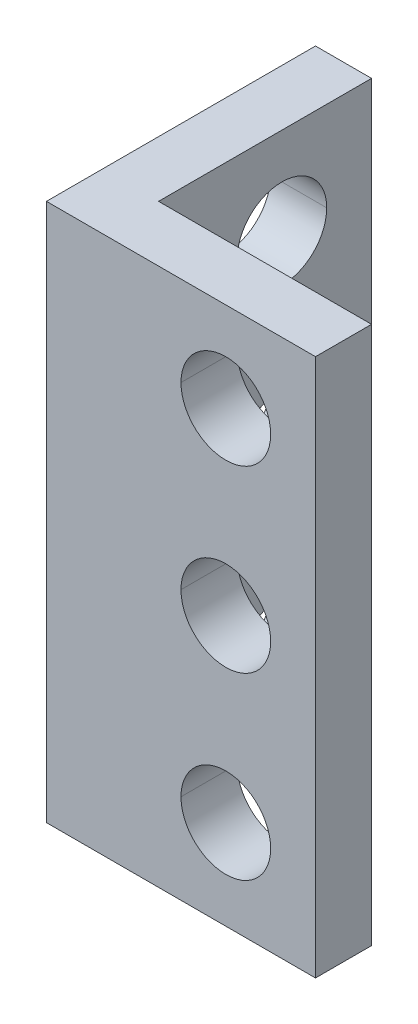
ISO-10303-21;
HEADER;
FILE_DESCRIPTION(('STEP AP214'),'2;1');
FILE_NAME('part.step','',(''),(''),'','','');
FILE_SCHEMA(('AUTOMOTIVE_DESIGN { 1 0 10303 214 1 1 1 1 }'));
ENDSEC;
DATA;
#1=APPLICATION_CONTEXT('core data for automotive mechanical design processes');
#2=APPLICATION_PROTOCOL_DEFINITION('international standard','automotive_design',2000,#1);
#3=PRODUCT_CONTEXT('',#1,'mechanical');
#4=PRODUCT('Part','Part','',(#3));
#5=PRODUCT_RELATED_PRODUCT_CATEGORY('part','',(#4));
#6=PRODUCT_DEFINITION_FORMATION('','',#4);
#7=PRODUCT_DEFINITION_CONTEXT('part definition',#1,'design');
#8=PRODUCT_DEFINITION('design','',#6,#7);
#9=PRODUCT_DEFINITION_SHAPE('','',#8);
#10=(LENGTH_UNIT() NAMED_UNIT(*) SI_UNIT(.MILLI.,.METRE.));
#11=(NAMED_UNIT(*) PLANE_ANGLE_UNIT() SI_UNIT($,.RADIAN.));
#12=(NAMED_UNIT(*) SI_UNIT($,.STERADIAN.) SOLID_ANGLE_UNIT());
#13=UNCERTAINTY_MEASURE_WITH_UNIT(LENGTH_MEASURE(1.E-05),#10,'distance_accuracy_value','');
#14=(GEOMETRIC_REPRESENTATION_CONTEXT(3) GLOBAL_UNCERTAINTY_ASSIGNED_CONTEXT((#13)) GLOBAL_UNIT_ASSIGNED_CONTEXT((#10,
#11,#12)) REPRESENTATION_CONTEXT('',''));
#15=CARTESIAN_POINT('',(0.,0.,0.));
#16=DIRECTION('',(0.,0.,1.));
#17=DIRECTION('',(1.,0.,0.));
#18=AXIS2_PLACEMENT_3D('',#15,#16,#17);
#19=CARTESIAN_POINT('',(12.,20.,-8.));
#20=DIRECTION('',(-1.,0.,0.));
#21=DIRECTION('',(0.,0.,1.));
#22=AXIS2_PLACEMENT_3D('',#19,#20,#21);
#23=CYLINDRICAL_SURFACE('',#22,2.);
#24=DIRECTION('',(-1.,0.,0.));
#25=VECTOR('',#24,1.);
#26=CARTESIAN_POINT('',(12.,20.,-10.));
#27=LINE('',#26,#25);
#28=CARTESIAN_POINT('',(2.5,20.,-10.));
#29=VERTEX_POINT('',#28);
#30=CARTESIAN_POINT('',(0.,20.,-10.));
#31=VERTEX_POINT('',#30);
#32=EDGE_CURVE('E275',#29,#31,#27,.T.);
#33=ORIENTED_EDGE('',*,*,#32,.F.);
#34=CARTESIAN_POINT('',(2.5,20.,-8.));
#35=DIRECTION('',(-1.,0.,0.));
#36=DIRECTION('',(0.,0.,1.));
#37=AXIS2_PLACEMENT_3D('',#34,#35,#36);
#38=CIRCLE('',#37,2.);
#39=CARTESIAN_POINT('',(2.5,20.,-6.));
#40=VERTEX_POINT('',#39);
#41=EDGE_CURVE('E302',#40,#29,#38,.T.);
#42=ORIENTED_EDGE('',*,*,#41,.F.);
#43=DIRECTION('',(-1.,0.,0.));
#44=VECTOR('',#43,1.);
#45=CARTESIAN_POINT('',(12.,20.,-6.));
#46=LINE('',#45,#44);
#47=CARTESIAN_POINT('',(0.,20.,-6.));
#48=VERTEX_POINT('',#47);
#49=EDGE_CURVE('E332',#40,#48,#46,.T.);
#50=ORIENTED_EDGE('',*,*,#49,.T.);
#51=CARTESIAN_POINT('',(0.,20.,-8.));
#52=DIRECTION('',(-1.,0.,0.));
#53=DIRECTION('',(0.,0.,1.));
#54=AXIS2_PLACEMENT_3D('',#51,#52,#53);
#55=CIRCLE('',#54,2.);
#56=EDGE_CURVE('E238',#48,#31,#55,.T.);
#57=ORIENTED_EDGE('',*,*,#56,.T.);
#58=EDGE_LOOP('',(#33,#42,#50,#57));
#59=FACE_BOUND('',#58,.T.);
#60=ADVANCED_FACE('F14',(#59),#23,.F.);
#61=CARTESIAN_POINT('',(12.,12.,-8.));
#62=DIRECTION('',(-1.,0.,0.));
#63=DIRECTION('',(0.,0.,1.));
#64=AXIS2_PLACEMENT_3D('',#61,#62,#63);
#65=CYLINDRICAL_SURFACE('',#64,2.);
#66=DIRECTION('',(-1.,0.,0.));
#67=VECTOR('',#66,1.);
#68=CARTESIAN_POINT('',(12.,12.,-10.));
#69=LINE('',#68,#67);
#70=CARTESIAN_POINT('',(2.5,12.,-10.));
#71=VERTEX_POINT('',#70);
#72=CARTESIAN_POINT('',(0.,12.,-10.));
#73=VERTEX_POINT('',#72);
#74=EDGE_CURVE('E284',#71,#73,#69,.T.);
#75=ORIENTED_EDGE('',*,*,#74,.F.);
#76=CARTESIAN_POINT('',(2.5,12.,-8.));
#77=DIRECTION('',(-1.,0.,0.));
#78=DIRECTION('',(0.,0.,1.));
#79=AXIS2_PLACEMENT_3D('',#76,#77,#78);
#80=CIRCLE('',#79,2.);
#81=CARTESIAN_POINT('',(2.5,12.,-6.));
#82=VERTEX_POINT('',#81);
#83=EDGE_CURVE('E271',#82,#71,#80,.T.);
#84=ORIENTED_EDGE('',*,*,#83,.F.);
#85=DIRECTION('',(-1.,0.,0.));
#86=VECTOR('',#85,1.);
#87=CARTESIAN_POINT('',(12.,12.,-6.));
#88=LINE('',#87,#86);
#89=CARTESIAN_POINT('',(0.,12.,-6.));
#90=VERTEX_POINT('',#89);
#91=EDGE_CURVE('E254',#82,#90,#88,.T.);
#92=ORIENTED_EDGE('',*,*,#91,.T.);
#93=CARTESIAN_POINT('',(0.,12.,-8.));
#94=DIRECTION('',(-1.,0.,0.));
#95=DIRECTION('',(0.,0.,1.));
#96=AXIS2_PLACEMENT_3D('',#93,#94,#95);
#97=CIRCLE('',#96,2.);
#98=EDGE_CURVE('E304',#90,#73,#97,.T.);
#99=ORIENTED_EDGE('',*,*,#98,.T.);
#100=EDGE_LOOP('',(#75,#84,#92,#99));
#101=FACE_BOUND('',#100,.T.);
#102=ADVANCED_FACE('F390',(#101),#65,.F.);
#103=CARTESIAN_POINT('',(8.,20.,-12.));
#104=DIRECTION('',(0.,0.,1.));
#105=DIRECTION('',(1.,0.,0.));
#106=AXIS2_PLACEMENT_3D('',#103,#104,#105);
#107=CYLINDRICAL_SURFACE('',#106,2.);
#108=DIRECTION('',(0.,0.,1.));
#109=VECTOR('',#108,1.);
#110=CARTESIAN_POINT('',(6.,20.,-12.));
#111=LINE('',#110,#109);
#112=CARTESIAN_POINT('',(6.,20.,-2.5));
#113=VERTEX_POINT('',#112);
#114=CARTESIAN_POINT('',(6.,20.,0.));
#115=VERTEX_POINT('',#114);
#116=EDGE_CURVE('E782',#113,#115,#111,.T.);
#117=ORIENTED_EDGE('',*,*,#116,.F.);
#118=CARTESIAN_POINT('',(8.,20.,-2.5));
#119=DIRECTION('',(0.,0.,1.));
#120=DIRECTION('',(-1.,0.,0.));
#121=AXIS2_PLACEMENT_3D('',#118,#119,#120);
#122=CIRCLE('',#121,2.);
#123=CARTESIAN_POINT('',(10.,20.,-2.50000000000004));
#124=VERTEX_POINT('',#123);
#125=EDGE_CURVE('E270',#124,#113,#122,.T.);
#126=ORIENTED_EDGE('',*,*,#125,.F.);
#127=DIRECTION('',(0.,0.,1.));
#128=VECTOR('',#127,1.);
#129=CARTESIAN_POINT('',(10.,20.,-12.));
#130=LINE('',#129,#128);
#131=CARTESIAN_POINT('',(10.,20.,0.));
#132=VERTEX_POINT('',#131);
#133=EDGE_CURVE('E285',#124,#132,#130,.T.);
#134=ORIENTED_EDGE('',*,*,#133,.T.);
#135=CARTESIAN_POINT('',(8.,20.,0.));
#136=DIRECTION('',(0.,0.,-1.));
#137=DIRECTION('',(-1.,0.,0.));
#138=AXIS2_PLACEMENT_3D('',#135,#136,#137);
#139=CIRCLE('',#138,2.);
#140=EDGE_CURVE('E325',#115,#132,#139,.T.);
#141=ORIENTED_EDGE('',*,*,#140,.F.);
#142=EDGE_LOOP('',(#117,#126,#134,#141));
#143=FACE_BOUND('',#142,.T.);
#144=ADVANCED_FACE('F395',(#143),#107,.F.);
#145=CARTESIAN_POINT('',(8.,12.,-12.));
#146=DIRECTION('',(0.,0.,1.));
#147=DIRECTION('',(1.,0.,0.));
#148=AXIS2_PLACEMENT_3D('',#145,#146,#147);
#149=CYLINDRICAL_SURFACE('',#148,2.);
#150=DIRECTION('',(0.,0.,1.));
#151=VECTOR('',#150,1.);
#152=CARTESIAN_POINT('',(6.,12.,-12.));
#153=LINE('',#152,#151);
#154=CARTESIAN_POINT('',(6.,12.,-2.5));
#155=VERTEX_POINT('',#154);
#156=CARTESIAN_POINT('',(6.,12.,0.));
#157=VERTEX_POINT('',#156);
#158=EDGE_CURVE('E242',#155,#157,#153,.T.);
#159=ORIENTED_EDGE('',*,*,#158,.F.);
#160=CARTESIAN_POINT('',(8.,12.,-2.5));
#161=DIRECTION('',(0.,0.,1.));
#162=DIRECTION('',(-1.,0.,0.));
#163=AXIS2_PLACEMENT_3D('',#160,#161,#162);
#164=CIRCLE('',#163,2.);
#165=CARTESIAN_POINT('',(10.,12.,-2.50000000000004));
#166=VERTEX_POINT('',#165);
#167=EDGE_CURVE('E216',#166,#155,#164,.T.);
#168=ORIENTED_EDGE('',*,*,#167,.F.);
#169=DIRECTION('',(0.,0.,1.));
#170=VECTOR('',#169,1.);
#171=CARTESIAN_POINT('',(10.,12.,-12.));
#172=LINE('',#171,#170);
#173=CARTESIAN_POINT('',(10.,12.,0.));
#174=VERTEX_POINT('',#173);
#175=EDGE_CURVE('E18',#166,#174,#172,.T.);
#176=ORIENTED_EDGE('',*,*,#175,.T.);
#177=CARTESIAN_POINT('',(8.,12.,0.));
#178=DIRECTION('',(0.,0.,-1.));
#179=DIRECTION('',(-1.,0.,0.));
#180=AXIS2_PLACEMENT_3D('',#177,#178,#179);
#181=CIRCLE('',#180,2.);
#182=EDGE_CURVE('E319',#157,#174,#181,.T.);
#183=ORIENTED_EDGE('',*,*,#182,.F.);
#184=EDGE_LOOP('',(#159,#168,#176,#183));
#185=FACE_BOUND('',#184,.T.);
#186=ADVANCED_FACE('F423',(#185),#149,.F.);
#187=CARTESIAN_POINT('',(0.,24.,0.));
#188=DIRECTION('',(0.,1.,0.));
#189=DIRECTION('',(1.,0.,0.));
#190=AXIS2_PLACEMENT_3D('',#187,#188,#189);
#191=PLANE('',#190);
#192=DIRECTION('',(1.,0.,0.));
#193=VECTOR('',#192,1.);
#194=CARTESIAN_POINT('',(0.,24.,-2.5));
#195=LINE('',#194,#193);
#196=CARTESIAN_POINT('',(2.5,24.,-2.5));
#197=VERTEX_POINT('',#196);
#198=CARTESIAN_POINT('',(12.,24.,-2.50000000000005));
#199=VERTEX_POINT('',#198);
#200=EDGE_CURVE('E202',#197,#199,#195,.T.);
#201=ORIENTED_EDGE('',*,*,#200,.F.);
#202=DIRECTION('',(0.,0.,-1.));
#203=VECTOR('',#202,1.);
#204=CARTESIAN_POINT('',(2.5,24.,0.));
#205=LINE('',#204,#203);
#206=CARTESIAN_POINT('',(2.5,24.,-12.));
#207=VERTEX_POINT('',#206);
#208=EDGE_CURVE('E274',#197,#207,#205,.T.);
#209=ORIENTED_EDGE('',*,*,#208,.T.);
#210=DIRECTION('',(1.,0.,0.));
#211=VECTOR('',#210,1.);
#212=CARTESIAN_POINT('',(0.,24.,-12.));
#213=LINE('',#212,#211);
#214=CARTESIAN_POINT('',(0.,24.,-12.));
#215=VERTEX_POINT('',#214);
#216=EDGE_CURVE('E234',#215,#207,#213,.T.);
#217=ORIENTED_EDGE('',*,*,#216,.F.);
#218=DIRECTION('',(0.,0.,-1.));
#219=VECTOR('',#218,1.);
#220=CARTESIAN_POINT('',(0.,24.,0.));
#221=LINE('',#220,#219);
#222=CARTESIAN_POINT('',(0.,24.,0.));
#223=VERTEX_POINT('',#222);
#224=EDGE_CURVE('E40',#223,#215,#221,.T.);
#225=ORIENTED_EDGE('',*,*,#224,.F.);
#226=DIRECTION('',(1.,0.,0.));
#227=VECTOR('',#226,1.);
#228=CARTESIAN_POINT('',(0.,24.,0.));
#229=LINE('',#228,#227);
#230=CARTESIAN_POINT('',(12.,24.,0.));
#231=VERTEX_POINT('',#230);
#232=EDGE_CURVE('E205',#223,#231,#229,.T.);
#233=ORIENTED_EDGE('',*,*,#232,.T.);
#234=DIRECTION('',(0.,0.,-1.));
#235=VECTOR('',#234,1.);
#236=CARTESIAN_POINT('',(12.,24.,0.));
#237=LINE('',#236,#235);
#238=EDGE_CURVE('E9',#231,#199,#237,.T.);
#239=ORIENTED_EDGE('',*,*,#238,.T.);
#240=EDGE_LOOP('',(#201,#209,#217,#225,#233,#239));
#241=FACE_BOUND('',#240,.T.);
#242=ADVANCED_FACE('F16',(#241),#191,.T.);
#243=CARTESIAN_POINT('',(8.,4.,-12.));
#244=DIRECTION('',(0.,0.,1.));
#245=DIRECTION('',(1.,0.,0.));
#246=AXIS2_PLACEMENT_3D('',#243,#244,#245);
#247=CYLINDRICAL_SURFACE('',#246,2.);
#248=DIRECTION('',(0.,0.,1.));
#249=VECTOR('',#248,1.);
#250=CARTESIAN_POINT('',(6.,4.,-12.));
#251=LINE('',#250,#249);
#252=CARTESIAN_POINT('',(6.,4.,-2.5));
#253=VERTEX_POINT('',#252);
#254=CARTESIAN_POINT('',(6.,4.,0.));
#255=VERTEX_POINT('',#254);
#256=EDGE_CURVE('E232',#253,#255,#251,.T.);
#257=ORIENTED_EDGE('',*,*,#256,.F.);
#258=CARTESIAN_POINT('',(8.,4.,-2.5));
#259=DIRECTION('',(0.,0.,1.));
#260=DIRECTION('',(-1.,0.,0.));
#261=AXIS2_PLACEMENT_3D('',#258,#259,#260);
#262=CIRCLE('',#261,2.);
#263=CARTESIAN_POINT('',(10.,4.,-2.50000000000004));
#264=VERTEX_POINT('',#263);
#265=EDGE_CURVE('E151',#264,#253,#262,.T.);
#266=ORIENTED_EDGE('',*,*,#265,.F.);
#267=DIRECTION('',(0.,0.,1.));
#268=VECTOR('',#267,1.);
#269=CARTESIAN_POINT('',(10.,4.,-12.));
#270=LINE('',#269,#268);
#271=CARTESIAN_POINT('',(10.,4.,0.));
#272=VERTEX_POINT('',#271);
#273=EDGE_CURVE('E264',#264,#272,#270,.T.);
#274=ORIENTED_EDGE('',*,*,#273,.T.);
#275=CARTESIAN_POINT('',(8.,4.,0.));
#276=DIRECTION('',(0.,0.,-1.));
#277=DIRECTION('',(-1.,0.,0.));
#278=AXIS2_PLACEMENT_3D('',#275,#276,#277);
#279=CIRCLE('',#278,2.);
#280=EDGE_CURVE('E805',#255,#272,#279,.T.);
#281=ORIENTED_EDGE('',*,*,#280,.F.);
#282=EDGE_LOOP('',(#257,#266,#274,#281));
#283=FACE_BOUND('',#282,.T.);
#284=ADVANCED_FACE('F491',(#283),#247,.F.);
#285=CARTESIAN_POINT('',(12.,4.,-8.));
#286=DIRECTION('',(-1.,0.,0.));
#287=DIRECTION('',(0.,0.,1.));
#288=AXIS2_PLACEMENT_3D('',#285,#286,#287);
#289=CYLINDRICAL_SURFACE('',#288,2.);
#290=DIRECTION('',(-1.,0.,0.));
#291=VECTOR('',#290,1.);
#292=CARTESIAN_POINT('',(12.,4.,-10.));
#293=LINE('',#292,#291);
#294=CARTESIAN_POINT('',(2.5,4.,-10.));
#295=VERTEX_POINT('',#294);
#296=CARTESIAN_POINT('',(0.,4.,-10.));
#297=VERTEX_POINT('',#296);
#298=EDGE_CURVE('E248',#295,#297,#293,.T.);
#299=ORIENTED_EDGE('',*,*,#298,.F.);
#300=CARTESIAN_POINT('',(2.5,4.,-8.));
#301=DIRECTION('',(-1.,0.,0.));
#302=DIRECTION('',(0.,0.,1.));
#303=AXIS2_PLACEMENT_3D('',#300,#301,#302);
#304=CIRCLE('',#303,2.);
#305=CARTESIAN_POINT('',(2.5,4.,-6.));
#306=VERTEX_POINT('',#305);
#307=EDGE_CURVE('E182',#306,#295,#304,.T.);
#308=ORIENTED_EDGE('',*,*,#307,.F.);
#309=DIRECTION('',(-1.,0.,0.));
#310=VECTOR('',#309,1.);
#311=CARTESIAN_POINT('',(12.,4.,-6.));
#312=LINE('',#311,#310);
#313=CARTESIAN_POINT('',(0.,4.,-6.));
#314=VERTEX_POINT('',#313);
#315=EDGE_CURVE('E778',#306,#314,#312,.T.);
#316=ORIENTED_EDGE('',*,*,#315,.T.);
#317=CARTESIAN_POINT('',(0.,4.,-8.));
#318=DIRECTION('',(-1.,0.,0.));
#319=DIRECTION('',(0.,0.,1.));
#320=AXIS2_PLACEMENT_3D('',#317,#318,#319);
#321=CIRCLE('',#320,2.);
#322=EDGE_CURVE('E175',#314,#297,#321,.T.);
#323=ORIENTED_EDGE('',*,*,#322,.T.);
#324=EDGE_LOOP('',(#299,#308,#316,#323));
#325=FACE_BOUND('',#324,.T.);
#326=ADVANCED_FACE('F381',(#325),#289,.F.);
#327=CARTESIAN_POINT('',(0.,0.,0.));
#328=DIRECTION('',(0.,1.,0.));
#329=DIRECTION('',(1.,0.,0.));
#330=AXIS2_PLACEMENT_3D('',#327,#328,#329);
#331=PLANE('',#330);
#332=DIRECTION('',(1.,0.,0.));
#333=VECTOR('',#332,1.);
#334=CARTESIAN_POINT('',(0.,0.,-2.5));
#335=LINE('',#334,#333);
#336=CARTESIAN_POINT('',(2.5,0.,-2.5));
#337=VERTEX_POINT('',#336);
#338=CARTESIAN_POINT('',(12.,0.,-2.50000000000005));
#339=VERTEX_POINT('',#338);
#340=EDGE_CURVE('E228',#337,#339,#335,.T.);
#341=ORIENTED_EDGE('',*,*,#340,.T.);
#342=DIRECTION('',(0.,0.,-1.));
#343=VECTOR('',#342,1.);
#344=CARTESIAN_POINT('',(12.,0.,0.));
#345=LINE('',#344,#343);
#346=CARTESIAN_POINT('',(12.,0.,0.));
#347=VERTEX_POINT('',#346);
#348=EDGE_CURVE('E25',#347,#339,#345,.T.);
#349=ORIENTED_EDGE('',*,*,#348,.F.);
#350=DIRECTION('',(1.,0.,0.));
#351=VECTOR('',#350,1.);
#352=CARTESIAN_POINT('',(0.,0.,0.));
#353=LINE('',#352,#351);
#354=CARTESIAN_POINT('',(0.,0.,0.));
#355=VERTEX_POINT('',#354);
#356=EDGE_CURVE('E265',#355,#347,#353,.T.);
#357=ORIENTED_EDGE('',*,*,#356,.F.);
#358=DIRECTION('',(0.,0.,-1.));
#359=VECTOR('',#358,1.);
#360=CARTESIAN_POINT('',(0.,0.,0.));
#361=LINE('',#360,#359);
#362=CARTESIAN_POINT('',(0.,0.,-12.));
#363=VERTEX_POINT('',#362);
#364=EDGE_CURVE('E236',#355,#363,#361,.T.);
#365=ORIENTED_EDGE('',*,*,#364,.T.);
#366=DIRECTION('',(1.,0.,0.));
#367=VECTOR('',#366,1.);
#368=CARTESIAN_POINT('',(0.,0.,-12.));
#369=LINE('',#368,#367);
#370=CARTESIAN_POINT('',(2.5,0.,-12.));
#371=VERTEX_POINT('',#370);
#372=EDGE_CURVE('E294',#363,#371,#369,.T.);
#373=ORIENTED_EDGE('',*,*,#372,.T.);
#374=DIRECTION('',(0.,0.,-1.));
#375=VECTOR('',#374,1.);
#376=CARTESIAN_POINT('',(2.5,0.,0.));
#377=LINE('',#376,#375);
#378=EDGE_CURVE('E321',#337,#371,#377,.T.);
#379=ORIENTED_EDGE('',*,*,#378,.F.);
#380=EDGE_LOOP('',(#341,#349,#357,#365,#373,#379));
#381=FACE_BOUND('',#380,.T.);
#382=ADVANCED_FACE('F376',(#381),#331,.F.);
#383=CARTESIAN_POINT('',(12.,8.,0.));
#384=DIRECTION('',(-1.,0.,0.));
#385=DIRECTION('',(0.,1.,0.));
#386=AXIS2_PLACEMENT_3D('',#383,#384,#385);
#387=PLANE('',#386);
#388=ORIENTED_EDGE('',*,*,#348,.T.);
#389=DIRECTION('',(0.,-1.,0.));
#390=VECTOR('',#389,1.);
#391=CARTESIAN_POINT('',(12.,8.,-2.50000000000005));
#392=LINE('',#391,#390);
#393=EDGE_CURVE('E210',#199,#339,#392,.T.);
#394=ORIENTED_EDGE('',*,*,#393,.F.);
#395=ORIENTED_EDGE('',*,*,#238,.F.);
#396=DIRECTION('',(0.,-1.,0.));
#397=VECTOR('',#396,1.);
#398=CARTESIAN_POINT('',(12.,8.,0.));
#399=LINE('',#398,#397);
#400=EDGE_CURVE('E269',#231,#347,#399,.T.);
#401=ORIENTED_EDGE('',*,*,#400,.T.);
#402=EDGE_LOOP('',(#388,#394,#395,#401));
#403=FACE_BOUND('',#402,.T.);
#404=ADVANCED_FACE('F211',(#403),#387,.F.);
#405=CARTESIAN_POINT('',(0.,8.,0.));
#406=DIRECTION('',(-1.,0.,0.));
#407=DIRECTION('',(0.,0.,1.));
#408=AXIS2_PLACEMENT_3D('',#405,#406,#407);
#409=PLANE('',#408);
#410=ORIENTED_EDGE('',*,*,#56,.F.);
#411=CARTESIAN_POINT('',(0.,20.,-8.));
#412=DIRECTION('',(-1.,0.,0.));
#413=DIRECTION('',(0.,0.,1.));
#414=AXIS2_PLACEMENT_3D('',#411,#412,#413);
#415=CIRCLE('',#414,2.);
#416=EDGE_CURVE('E279',#31,#48,#415,.T.);
#417=ORIENTED_EDGE('',*,*,#416,.F.);
#418=EDGE_LOOP('',(#410,#417));
#419=FACE_BOUND('',#418,.T.);
#420=ORIENTED_EDGE('',*,*,#322,.F.);
#421=CARTESIAN_POINT('',(0.,4.,-8.));
#422=DIRECTION('',(-1.,0.,0.));
#423=DIRECTION('',(0.,0.,1.));
#424=AXIS2_PLACEMENT_3D('',#421,#422,#423);
#425=CIRCLE('',#424,2.);
#426=EDGE_CURVE('E252',#297,#314,#425,.T.);
#427=ORIENTED_EDGE('',*,*,#426,.F.);
#428=EDGE_LOOP('',(#420,#427));
#429=FACE_BOUND('',#428,.T.);
#430=ORIENTED_EDGE('',*,*,#98,.F.);
#431=CARTESIAN_POINT('',(0.,12.,-8.));
#432=DIRECTION('',(-1.,0.,0.));
#433=DIRECTION('',(0.,0.,1.));
#434=AXIS2_PLACEMENT_3D('',#431,#432,#433);
#435=CIRCLE('',#434,2.);
#436=EDGE_CURVE('E259',#73,#90,#435,.T.);
#437=ORIENTED_EDGE('',*,*,#436,.F.);
#438=EDGE_LOOP('',(#430,#437));
#439=FACE_BOUND('',#438,.T.);
#440=ORIENTED_EDGE('',*,*,#364,.F.);
#441=DIRECTION('',(0.,-1.,0.));
#442=VECTOR('',#441,1.);
#443=CARTESIAN_POINT('',(0.,8.,0.));
#444=LINE('',#443,#442);
#445=EDGE_CURVE('E808',#223,#355,#444,.T.);
#446=ORIENTED_EDGE('',*,*,#445,.F.);
#447=ORIENTED_EDGE('',*,*,#224,.T.);
#448=DIRECTION('',(0.,-1.,0.));
#449=VECTOR('',#448,1.);
#450=CARTESIAN_POINT('',(0.,8.,-12.));
#451=LINE('',#450,#449);
#452=EDGE_CURVE('E237',#215,#363,#451,.T.);
#453=ORIENTED_EDGE('',*,*,#452,.T.);
#454=EDGE_LOOP('',(#440,#446,#447,#453));
#455=FACE_BOUND('',#454,.T.);
#456=ADVANCED_FACE('F459',(#419,#429,#439,#455),#409,.T.);
#457=CARTESIAN_POINT('',(0.,8.,-12.));
#458=DIRECTION('',(0.,0.,-1.));
#459=DIRECTION('',(0.,-1.,0.));
#460=AXIS2_PLACEMENT_3D('',#457,#458,#459);
#461=PLANE('',#460);
#462=ORIENTED_EDGE('',*,*,#372,.F.);
#463=ORIENTED_EDGE('',*,*,#452,.F.);
#464=ORIENTED_EDGE('',*,*,#216,.T.);
#465=DIRECTION('',(0.,-1.,0.));
#466=VECTOR('',#465,1.);
#467=CARTESIAN_POINT('',(2.5,8.,-12.));
#468=LINE('',#467,#466);
#469=EDGE_CURVE('E324',#207,#371,#468,.T.);
#470=ORIENTED_EDGE('',*,*,#469,.T.);
#471=EDGE_LOOP('',(#462,#463,#464,#470));
#472=FACE_BOUND('',#471,.T.);
#473=ADVANCED_FACE('F437',(#472),#461,.T.);
#474=CARTESIAN_POINT('',(2.5,8.,0.));
#475=DIRECTION('',(-1.,0.,0.));
#476=DIRECTION('',(0.,0.,1.));
#477=AXIS2_PLACEMENT_3D('',#474,#475,#476);
#478=PLANE('',#477);
#479=ORIENTED_EDGE('',*,*,#41,.T.);
#480=CARTESIAN_POINT('',(2.5,20.,-8.));
#481=DIRECTION('',(-1.,0.,0.));
#482=DIRECTION('',(0.,0.,1.));
#483=AXIS2_PLACEMENT_3D('',#480,#481,#482);
#484=CIRCLE('',#483,2.);
#485=EDGE_CURVE('E280',#29,#40,#484,.T.);
#486=ORIENTED_EDGE('',*,*,#485,.T.);
#487=EDGE_LOOP('',(#479,#486));
#488=FACE_BOUND('',#487,.T.);
#489=ORIENTED_EDGE('',*,*,#307,.T.);
#490=CARTESIAN_POINT('',(2.5,4.,-8.));
#491=DIRECTION('',(-1.,0.,0.));
#492=DIRECTION('',(0.,0.,1.));
#493=AXIS2_PLACEMENT_3D('',#490,#491,#492);
#494=CIRCLE('',#493,2.);
#495=EDGE_CURVE('E253',#295,#306,#494,.T.);
#496=ORIENTED_EDGE('',*,*,#495,.T.);
#497=EDGE_LOOP('',(#489,#496));
#498=FACE_BOUND('',#497,.T.);
#499=ORIENTED_EDGE('',*,*,#83,.T.);
#500=CARTESIAN_POINT('',(2.5,12.,-8.));
#501=DIRECTION('',(-1.,0.,0.));
#502=DIRECTION('',(0.,0.,1.));
#503=AXIS2_PLACEMENT_3D('',#500,#501,#502);
#504=CIRCLE('',#503,2.);
#505=EDGE_CURVE('E336',#71,#82,#504,.T.);
#506=ORIENTED_EDGE('',*,*,#505,.T.);
#507=EDGE_LOOP('',(#499,#506));
#508=FACE_BOUND('',#507,.T.);
#509=ORIENTED_EDGE('',*,*,#378,.T.);
#510=ORIENTED_EDGE('',*,*,#469,.F.);
#511=ORIENTED_EDGE('',*,*,#208,.F.);
#512=DIRECTION('',(0.,-1.,0.));
#513=VECTOR('',#512,1.);
#514=CARTESIAN_POINT('',(2.5,8.,-2.5));
#515=LINE('',#514,#513);
#516=EDGE_CURVE('E220',#197,#337,#515,.T.);
#517=ORIENTED_EDGE('',*,*,#516,.T.);
#518=EDGE_LOOP('',(#509,#510,#511,#517));
#519=FACE_BOUND('',#518,.T.);
#520=ADVANCED_FACE('F432',(#488,#498,#508,#519),#478,.F.);
#521=CARTESIAN_POINT('',(0.,8.,0.));
#522=DIRECTION('',(0.,0.,-1.));
#523=DIRECTION('',(-1.,0.,0.));
#524=AXIS2_PLACEMENT_3D('',#521,#522,#523);
#525=PLANE('',#524);
#526=CARTESIAN_POINT('',(8.,20.,0.));
#527=DIRECTION('',(0.,0.,-1.));
#528=DIRECTION('',(-1.,0.,0.));
#529=AXIS2_PLACEMENT_3D('',#526,#527,#528);
#530=CIRCLE('',#529,2.);
#531=EDGE_CURVE('E288',#132,#115,#530,.T.);
#532=ORIENTED_EDGE('',*,*,#531,.T.);
#533=ORIENTED_EDGE('',*,*,#140,.T.);
#534=EDGE_LOOP('',(#532,#533));
#535=FACE_BOUND('',#534,.T.);
#536=CARTESIAN_POINT('',(8.,12.,0.));
#537=DIRECTION('',(0.,0.,-1.));
#538=DIRECTION('',(-1.,0.,0.));
#539=AXIS2_PLACEMENT_3D('',#536,#537,#538);
#540=CIRCLE('',#539,2.);
#541=EDGE_CURVE('E246',#174,#157,#540,.T.);
#542=ORIENTED_EDGE('',*,*,#541,.T.);
#543=ORIENTED_EDGE('',*,*,#182,.T.);
#544=EDGE_LOOP('',(#542,#543));
#545=FACE_BOUND('',#544,.T.);
#546=CARTESIAN_POINT('',(8.,4.,0.));
#547=DIRECTION('',(0.,0.,-1.));
#548=DIRECTION('',(-1.,0.,0.));
#549=AXIS2_PLACEMENT_3D('',#546,#547,#548);
#550=CIRCLE('',#549,2.);
#551=EDGE_CURVE('E260',#272,#255,#550,.T.);
#552=ORIENTED_EDGE('',*,*,#551,.T.);
#553=ORIENTED_EDGE('',*,*,#280,.T.);
#554=EDGE_LOOP('',(#552,#553));
#555=FACE_BOUND('',#554,.T.);
#556=ORIENTED_EDGE('',*,*,#356,.T.);
#557=ORIENTED_EDGE('',*,*,#400,.F.);
#558=ORIENTED_EDGE('',*,*,#232,.F.);
#559=ORIENTED_EDGE('',*,*,#445,.T.);
#560=EDGE_LOOP('',(#556,#557,#558,#559));
#561=FACE_BOUND('',#560,.T.);
#562=ADVANCED_FACE('F410',(#535,#545,#555,#561),#525,.F.);
#563=CARTESIAN_POINT('',(0.,8.,-2.5));
#564=DIRECTION('',(0.,0.,-1.));
#565=DIRECTION('',(-1.,0.,0.));
#566=AXIS2_PLACEMENT_3D('',#563,#564,#565);
#567=PLANE('',#566);
#568=ORIENTED_EDGE('',*,*,#125,.T.);
#569=CARTESIAN_POINT('',(8.,20.,-2.5));
#570=DIRECTION('',(0.,0.,1.));
#571=DIRECTION('',(-1.,0.,0.));
#572=AXIS2_PLACEMENT_3D('',#569,#570,#571);
#573=CIRCLE('',#572,2.);
#574=EDGE_CURVE('E258',#113,#124,#573,.T.);
#575=ORIENTED_EDGE('',*,*,#574,.T.);
#576=EDGE_LOOP('',(#568,#575));
#577=FACE_BOUND('',#576,.T.);
#578=ORIENTED_EDGE('',*,*,#265,.T.);
#579=CARTESIAN_POINT('',(8.,4.,-2.5));
#580=DIRECTION('',(0.,0.,1.));
#581=DIRECTION('',(-1.,0.,0.));
#582=AXIS2_PLACEMENT_3D('',#579,#580,#581);
#583=CIRCLE('',#582,2.);
#584=EDGE_CURVE('E298',#253,#264,#583,.T.);
#585=ORIENTED_EDGE('',*,*,#584,.T.);
#586=EDGE_LOOP('',(#578,#585));
#587=FACE_BOUND('',#586,.T.);
#588=ORIENTED_EDGE('',*,*,#167,.T.);
#589=CARTESIAN_POINT('',(8.,12.,-2.5));
#590=DIRECTION('',(0.,0.,1.));
#591=DIRECTION('',(-1.,0.,0.));
#592=AXIS2_PLACEMENT_3D('',#589,#590,#591);
#593=CIRCLE('',#592,2.);
#594=EDGE_CURVE('E247',#155,#166,#593,.T.);
#595=ORIENTED_EDGE('',*,*,#594,.T.);
#596=EDGE_LOOP('',(#588,#595));
#597=FACE_BOUND('',#596,.T.);
#598=ORIENTED_EDGE('',*,*,#340,.F.);
#599=ORIENTED_EDGE('',*,*,#516,.F.);
#600=ORIENTED_EDGE('',*,*,#200,.T.);
#601=ORIENTED_EDGE('',*,*,#393,.T.);
#602=EDGE_LOOP('',(#598,#599,#600,#601));
#603=FACE_BOUND('',#602,.T.);
#604=ADVANCED_FACE('F218',(#577,#587,#597,#603),#567,.T.);
#605=CARTESIAN_POINT('',(12.,4.,-8.));
#606=DIRECTION('',(-1.,0.,0.));
#607=DIRECTION('',(0.,0.,1.));
#608=AXIS2_PLACEMENT_3D('',#605,#606,#607);
#609=CYLINDRICAL_SURFACE('',#608,2.);
#610=ORIENTED_EDGE('',*,*,#495,.F.);
#611=ORIENTED_EDGE('',*,*,#298,.T.);
#612=ORIENTED_EDGE('',*,*,#426,.T.);
#613=ORIENTED_EDGE('',*,*,#315,.F.);
#614=EDGE_LOOP('',(#610,#611,#612,#613));
#615=FACE_BOUND('',#614,.T.);
#616=ADVANCED_FACE('F409',(#615),#609,.F.);
#617=CARTESIAN_POINT('',(8.,4.,-12.));
#618=DIRECTION('',(0.,0.,1.));
#619=DIRECTION('',(1.,0.,0.));
#620=AXIS2_PLACEMENT_3D('',#617,#618,#619);
#621=CYLINDRICAL_SURFACE('',#620,2.);
#622=ORIENTED_EDGE('',*,*,#584,.F.);
#623=ORIENTED_EDGE('',*,*,#256,.T.);
#624=ORIENTED_EDGE('',*,*,#551,.F.);
#625=ORIENTED_EDGE('',*,*,#273,.F.);
#626=EDGE_LOOP('',(#622,#623,#624,#625));
#627=FACE_BOUND('',#626,.T.);
#628=ADVANCED_FACE('F529',(#627),#621,.F.);
#629=CARTESIAN_POINT('',(8.,12.,-12.));
#630=DIRECTION('',(0.,0.,1.));
#631=DIRECTION('',(1.,0.,0.));
#632=AXIS2_PLACEMENT_3D('',#629,#630,#631);
#633=CYLINDRICAL_SURFACE('',#632,2.);
#634=ORIENTED_EDGE('',*,*,#594,.F.);
#635=ORIENTED_EDGE('',*,*,#158,.T.);
#636=ORIENTED_EDGE('',*,*,#541,.F.);
#637=ORIENTED_EDGE('',*,*,#175,.F.);
#638=EDGE_LOOP('',(#634,#635,#636,#637));
#639=FACE_BOUND('',#638,.T.);
#640=ADVANCED_FACE('F347',(#639),#633,.F.);
#641=CARTESIAN_POINT('',(8.,20.,-12.));
#642=DIRECTION('',(0.,0.,1.));
#643=DIRECTION('',(1.,0.,0.));
#644=AXIS2_PLACEMENT_3D('',#641,#642,#643);
#645=CYLINDRICAL_SURFACE('',#644,2.);
#646=ORIENTED_EDGE('',*,*,#574,.F.);
#647=ORIENTED_EDGE('',*,*,#116,.T.);
#648=ORIENTED_EDGE('',*,*,#531,.F.);
#649=ORIENTED_EDGE('',*,*,#133,.F.);
#650=EDGE_LOOP('',(#646,#647,#648,#649));
#651=FACE_BOUND('',#650,.T.);
#652=ADVANCED_FACE('F365',(#651),#645,.F.);
#653=CARTESIAN_POINT('',(12.,12.,-8.));
#654=DIRECTION('',(-1.,0.,0.));
#655=DIRECTION('',(0.,0.,1.));
#656=AXIS2_PLACEMENT_3D('',#653,#654,#655);
#657=CYLINDRICAL_SURFACE('',#656,2.);
#658=ORIENTED_EDGE('',*,*,#505,.F.);
#659=ORIENTED_EDGE('',*,*,#74,.T.);
#660=ORIENTED_EDGE('',*,*,#436,.T.);
#661=ORIENTED_EDGE('',*,*,#91,.F.);
#662=EDGE_LOOP('',(#658,#659,#660,#661));
#663=FACE_BOUND('',#662,.T.);
#664=ADVANCED_FACE('F359',(#663),#657,.F.);
#665=CARTESIAN_POINT('',(12.,20.,-8.));
#666=DIRECTION('',(-1.,0.,0.));
#667=DIRECTION('',(0.,0.,1.));
#668=AXIS2_PLACEMENT_3D('',#665,#666,#667);
#669=CYLINDRICAL_SURFACE('',#668,2.);
#670=ORIENTED_EDGE('',*,*,#485,.F.);
#671=ORIENTED_EDGE('',*,*,#32,.T.);
#672=ORIENTED_EDGE('',*,*,#416,.T.);
#673=ORIENTED_EDGE('',*,*,#49,.F.);
#674=EDGE_LOOP('',(#670,#671,#672,#673));
#675=FACE_BOUND('',#674,.T.);
#676=ADVANCED_FACE('F364',(#675),#669,.F.);
#677=CLOSED_SHELL('',(#60,#102,#144,#186,#242,#284,#326,#382,#404,#456,#473,#520,#562,#604,#616,
#628,#640,#652,#664,#676));
#678=MANIFOLD_SOLID_BREP('B1',#677);
#679=ADVANCED_BREP_SHAPE_REPRESENTATION('',(#18,#678),#14);
#680=SHAPE_DEFINITION_REPRESENTATION(#9,#679);
ENDSEC;
END-ISO-10303-21;
